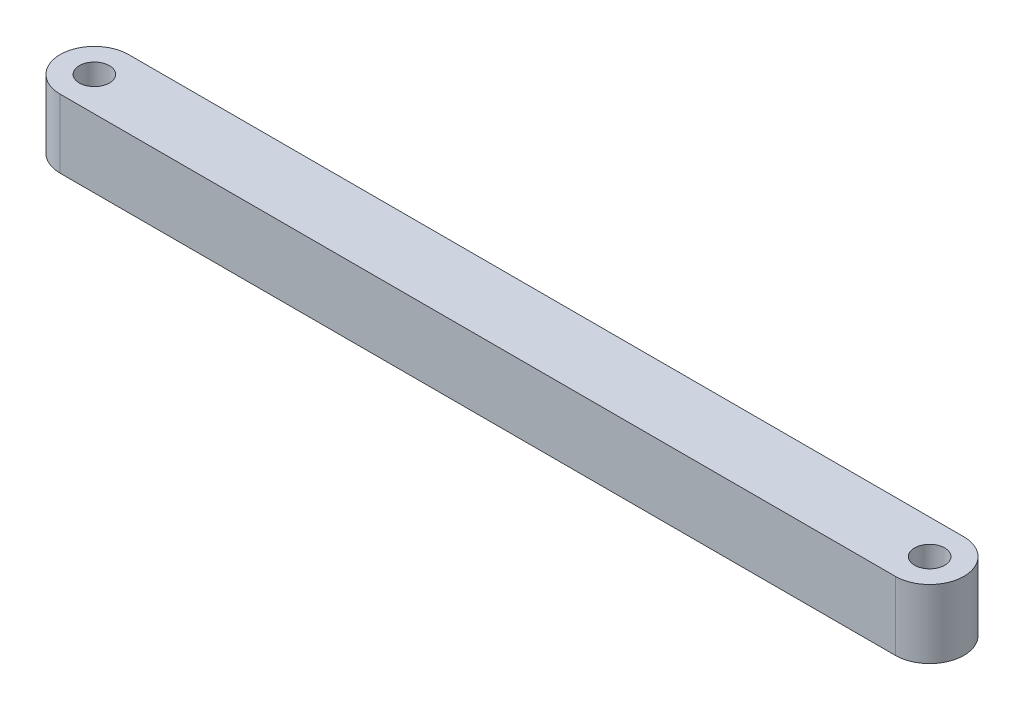
ISO-10303-21;
HEADER;
FILE_DESCRIPTION(('STEP AP214'),'2;1');
FILE_NAME('part.step','',(''),(''),'','','');
FILE_SCHEMA(('AUTOMOTIVE_DESIGN { 1 0 10303 214 1 1 1 1 }'));
ENDSEC;
DATA;
#1=APPLICATION_CONTEXT('core data for automotive mechanical design processes');
#2=APPLICATION_PROTOCOL_DEFINITION('international standard','automotive_design',2000,#1);
#3=PRODUCT_CONTEXT('',#1,'mechanical');
#4=PRODUCT('Part','Part','',(#3));
#5=PRODUCT_RELATED_PRODUCT_CATEGORY('part','',(#4));
#6=PRODUCT_DEFINITION_FORMATION('','',#4);
#7=PRODUCT_DEFINITION_CONTEXT('part definition',#1,'design');
#8=PRODUCT_DEFINITION('design','',#6,#7);
#9=PRODUCT_DEFINITION_SHAPE('','',#8);
#10=(LENGTH_UNIT() NAMED_UNIT(*) SI_UNIT(.MILLI.,.METRE.));
#11=(NAMED_UNIT(*) PLANE_ANGLE_UNIT() SI_UNIT($,.RADIAN.));
#12=(NAMED_UNIT(*) SI_UNIT($,.STERADIAN.) SOLID_ANGLE_UNIT());
#13=UNCERTAINTY_MEASURE_WITH_UNIT(LENGTH_MEASURE(1.E-05),#10,'distance_accuracy_value','');
#14=(GEOMETRIC_REPRESENTATION_CONTEXT(3) GLOBAL_UNCERTAINTY_ASSIGNED_CONTEXT((#13)) GLOBAL_UNIT_ASSIGNED_CONTEXT((#10,
#11,#12)) REPRESENTATION_CONTEXT('',''));
#15=CARTESIAN_POINT('',(0.,0.,0.));
#16=DIRECTION('',(0.,0.,1.));
#17=DIRECTION('',(1.,0.,0.));
#18=AXIS2_PLACEMENT_3D('',#15,#16,#17);
#19=CARTESIAN_POINT('',(-58.7,5.,0.));
#20=DIRECTION('',(0.,1.,0.));
#21=DIRECTION('',(0.,0.,1.));
#22=AXIS2_PLACEMENT_3D('',#19,#20,#21);
#23=PLANE('',#22);
#24=CARTESIAN_POINT('',(2.26469372,5.,0.));
#25=DIRECTION('',(0.,1.,0.));
#26=DIRECTION('',(0.,0.,1.));
#27=AXIS2_PLACEMENT_3D('',#24,#25,#26);
#28=CIRCLE('',#27,1.1);
#29=CARTESIAN_POINT('',(2.26469372,5.,1.1));
#30=VERTEX_POINT('',#29);
#31=EDGE_CURVE('E108',#30,#30,#28,.T.);
#32=ORIENTED_EDGE('',*,*,#31,.F.);
#33=EDGE_LOOP('',(#32));
#34=FACE_BOUND('',#33,.T.);
#35=CARTESIAN_POINT('',(-58.7,5.,0.));
#36=DIRECTION('',(0.,1.,0.));
#37=DIRECTION('',(0.,0.,1.));
#38=AXIS2_PLACEMENT_3D('',#35,#36,#37);
#39=CIRCLE('',#38,2.5);
#40=CARTESIAN_POINT('',(-58.7,5.,-2.5));
#41=VERTEX_POINT('',#40);
#42=CARTESIAN_POINT('',(-58.7,5.,2.5));
#43=VERTEX_POINT('',#42);
#44=EDGE_CURVE('E93',#41,#43,#39,.T.);
#45=ORIENTED_EDGE('',*,*,#44,.T.);
#46=DIRECTION('',(1.,0.,0.));
#47=VECTOR('',#46,1.);
#48=CARTESIAN_POINT('',(-58.7,5.,2.5));
#49=LINE('',#48,#47);
#50=CARTESIAN_POINT('',(2.26469372,5.,2.5));
#51=VERTEX_POINT('',#50);
#52=EDGE_CURVE('E88',#43,#51,#49,.T.);
#53=ORIENTED_EDGE('',*,*,#52,.T.);
#54=CARTESIAN_POINT('',(2.26469372,5.,0.));
#55=DIRECTION('',(0.,1.,0.));
#56=DIRECTION('',(0.,0.,1.));
#57=AXIS2_PLACEMENT_3D('',#54,#55,#56);
#58=CIRCLE('',#57,2.5);
#59=CARTESIAN_POINT('',(2.26469372,5.,-2.5));
#60=VERTEX_POINT('',#59);
#61=EDGE_CURVE('E91',#51,#60,#58,.T.);
#62=ORIENTED_EDGE('',*,*,#61,.T.);
#63=DIRECTION('',(-1.,0.,0.));
#64=VECTOR('',#63,1.);
#65=CARTESIAN_POINT('',(-58.7,5.,-2.5));
#66=LINE('',#65,#64);
#67=EDGE_CURVE('E58',#60,#41,#66,.T.);
#68=ORIENTED_EDGE('',*,*,#67,.T.);
#69=EDGE_LOOP('',(#45,#53,#62,#68));
#70=FACE_BOUND('',#69,.T.);
#71=CARTESIAN_POINT('',(-58.7,5.,0.));
#72=DIRECTION('',(0.,1.,0.));
#73=DIRECTION('',(0.,0.,1.));
#74=AXIS2_PLACEMENT_3D('',#71,#72,#73);
#75=CIRCLE('',#74,1.1);
#76=CARTESIAN_POINT('',(-58.7,5.,1.1));
#77=VERTEX_POINT('',#76);
#78=EDGE_CURVE('E123',#77,#77,#75,.T.);
#79=ORIENTED_EDGE('',*,*,#78,.F.);
#80=EDGE_LOOP('',(#79));
#81=FACE_BOUND('',#80,.T.);
#82=ADVANCED_FACE('F41',(#34,#70,#81),#23,.T.);
#83=CARTESIAN_POINT('',(-58.7,0.,0.));
#84=DIRECTION('',(0.,1.,0.));
#85=DIRECTION('',(0.,0.,1.));
#86=AXIS2_PLACEMENT_3D('',#83,#84,#85);
#87=PLANE('',#86);
#88=CARTESIAN_POINT('',(-58.7,0.,0.));
#89=DIRECTION('',(0.,1.,0.));
#90=DIRECTION('',(0.,0.,1.));
#91=AXIS2_PLACEMENT_3D('',#88,#89,#90);
#92=CIRCLE('',#91,2.5);
#93=CARTESIAN_POINT('',(-58.7,0.,-2.5));
#94=VERTEX_POINT('',#93);
#95=CARTESIAN_POINT('',(-58.7,0.,2.5));
#96=VERTEX_POINT('',#95);
#97=EDGE_CURVE('E105',#94,#96,#92,.T.);
#98=ORIENTED_EDGE('',*,*,#97,.F.);
#99=DIRECTION('',(-1.,0.,0.));
#100=VECTOR('',#99,1.);
#101=CARTESIAN_POINT('',(-58.7,0.,-2.5));
#102=LINE('',#101,#100);
#103=CARTESIAN_POINT('',(2.26469372,0.,-2.5));
#104=VERTEX_POINT('',#103);
#105=EDGE_CURVE('E81',#104,#94,#102,.T.);
#106=ORIENTED_EDGE('',*,*,#105,.F.);
#107=CARTESIAN_POINT('',(2.26469372,0.,0.));
#108=DIRECTION('',(0.,1.,0.));
#109=DIRECTION('',(0.,0.,1.));
#110=AXIS2_PLACEMENT_3D('',#107,#108,#109);
#111=CIRCLE('',#110,2.5);
#112=CARTESIAN_POINT('',(2.26469372,0.,2.5));
#113=VERTEX_POINT('',#112);
#114=EDGE_CURVE('E75',#113,#104,#111,.T.);
#115=ORIENTED_EDGE('',*,*,#114,.F.);
#116=DIRECTION('',(1.,0.,0.));
#117=VECTOR('',#116,1.);
#118=CARTESIAN_POINT('',(-58.7,0.,2.5));
#119=LINE('',#118,#117);
#120=EDGE_CURVE('E97',#96,#113,#119,.T.);
#121=ORIENTED_EDGE('',*,*,#120,.F.);
#122=EDGE_LOOP('',(#98,#106,#115,#121));
#123=FACE_BOUND('',#122,.T.);
#124=CARTESIAN_POINT('',(2.26469372,0.,0.));
#125=DIRECTION('',(0.,1.,0.));
#126=DIRECTION('',(0.,0.,1.));
#127=AXIS2_PLACEMENT_3D('',#124,#125,#126);
#128=CIRCLE('',#127,1.1);
#129=CARTESIAN_POINT('',(2.26469372,0.,1.1));
#130=VERTEX_POINT('',#129);
#131=EDGE_CURVE('E120',#130,#130,#128,.T.);
#132=ORIENTED_EDGE('',*,*,#131,.T.);
#133=EDGE_LOOP('',(#132));
#134=FACE_BOUND('',#133,.T.);
#135=CARTESIAN_POINT('',(-58.7,0.,0.));
#136=DIRECTION('',(0.,1.,0.));
#137=DIRECTION('',(0.,0.,1.));
#138=AXIS2_PLACEMENT_3D('',#135,#136,#137);
#139=CIRCLE('',#138,1.1);
#140=CARTESIAN_POINT('',(-58.7,0.,1.1));
#141=VERTEX_POINT('',#140);
#142=EDGE_CURVE('E126',#141,#141,#139,.T.);
#143=ORIENTED_EDGE('',*,*,#142,.T.);
#144=EDGE_LOOP('',(#143));
#145=FACE_BOUND('',#144,.T.);
#146=ADVANCED_FACE('F116',(#123,#134,#145),#87,.F.);
#147=CARTESIAN_POINT('',(-58.7,5.,0.));
#148=DIRECTION('',(0.,-1.,0.));
#149=DIRECTION('',(0.,0.,-1.));
#150=AXIS2_PLACEMENT_3D('',#147,#148,#149);
#151=CYLINDRICAL_SURFACE('',#150,2.5);
#152=ORIENTED_EDGE('',*,*,#97,.T.);
#153=DIRECTION('',(0.,-1.,0.));
#154=VECTOR('',#153,1.);
#155=CARTESIAN_POINT('',(-58.7,5.,2.5));
#156=LINE('',#155,#154);
#157=EDGE_CURVE('E11',#43,#96,#156,.T.);
#158=ORIENTED_EDGE('',*,*,#157,.F.);
#159=ORIENTED_EDGE('',*,*,#44,.F.);
#160=DIRECTION('',(0.,-1.,0.));
#161=VECTOR('',#160,1.);
#162=CARTESIAN_POINT('',(-58.7,5.,-2.5));
#163=LINE('',#162,#161);
#164=EDGE_CURVE('E101',#41,#94,#163,.T.);
#165=ORIENTED_EDGE('',*,*,#164,.T.);
#166=EDGE_LOOP('',(#152,#158,#159,#165));
#167=FACE_BOUND('',#166,.T.);
#168=ADVANCED_FACE('F43',(#167),#151,.T.);
#169=CARTESIAN_POINT('',(-58.7,5.,2.5));
#170=DIRECTION('',(0.,0.,-1.));
#171=DIRECTION('',(-1.,0.,0.));
#172=AXIS2_PLACEMENT_3D('',#169,#170,#171);
#173=PLANE('',#172);
#174=ORIENTED_EDGE('',*,*,#120,.T.);
#175=DIRECTION('',(0.,-1.,0.));
#176=VECTOR('',#175,1.);
#177=CARTESIAN_POINT('',(2.26469372,5.,2.5));
#178=LINE('',#177,#176);
#179=EDGE_CURVE('E50',#51,#113,#178,.T.);
#180=ORIENTED_EDGE('',*,*,#179,.F.);
#181=ORIENTED_EDGE('',*,*,#52,.F.);
#182=ORIENTED_EDGE('',*,*,#157,.T.);
#183=EDGE_LOOP('',(#174,#180,#181,#182));
#184=FACE_BOUND('',#183,.T.);
#185=ADVANCED_FACE('F96',(#184),#173,.F.);
#186=CARTESIAN_POINT('',(2.26469372,5.,0.));
#187=DIRECTION('',(0.,-1.,0.));
#188=DIRECTION('',(0.,0.,-1.));
#189=AXIS2_PLACEMENT_3D('',#186,#187,#188);
#190=CYLINDRICAL_SURFACE('',#189,2.5);
#191=ORIENTED_EDGE('',*,*,#114,.T.);
#192=DIRECTION('',(0.,-1.,0.));
#193=VECTOR('',#192,1.);
#194=CARTESIAN_POINT('',(2.26469372,5.,-2.5));
#195=LINE('',#194,#193);
#196=EDGE_CURVE('E98',#60,#104,#195,.T.);
#197=ORIENTED_EDGE('',*,*,#196,.F.);
#198=ORIENTED_EDGE('',*,*,#61,.F.);
#199=ORIENTED_EDGE('',*,*,#179,.T.);
#200=EDGE_LOOP('',(#191,#197,#198,#199));
#201=FACE_BOUND('',#200,.T.);
#202=ADVANCED_FACE('F99',(#201),#190,.T.);
#203=CARTESIAN_POINT('',(-58.7,5.,-2.5));
#204=DIRECTION('',(0.,0.,1.));
#205=DIRECTION('',(1.,0.,0.));
#206=AXIS2_PLACEMENT_3D('',#203,#204,#205);
#207=PLANE('',#206);
#208=ORIENTED_EDGE('',*,*,#105,.T.);
#209=ORIENTED_EDGE('',*,*,#164,.F.);
#210=ORIENTED_EDGE('',*,*,#67,.F.);
#211=ORIENTED_EDGE('',*,*,#196,.T.);
#212=EDGE_LOOP('',(#208,#209,#210,#211));
#213=FACE_BOUND('',#212,.T.);
#214=ADVANCED_FACE('F113',(#213),#207,.F.);
#215=CARTESIAN_POINT('',(2.26469372,5.,0.));
#216=DIRECTION('',(0.,-1.,0.));
#217=DIRECTION('',(0.,0.,-1.));
#218=AXIS2_PLACEMENT_3D('',#215,#216,#217);
#219=CYLINDRICAL_SURFACE('',#218,1.1);
#220=ORIENTED_EDGE('',*,*,#31,.T.);
#221=EDGE_LOOP('',(#220));
#222=FACE_BOUND('',#221,.T.);
#223=ORIENTED_EDGE('',*,*,#131,.F.);
#224=EDGE_LOOP('',(#223));
#225=FACE_BOUND('',#224,.T.);
#226=ADVANCED_FACE('F143',(#222,#225),#219,.F.);
#227=CARTESIAN_POINT('',(-58.7,5.,0.));
#228=DIRECTION('',(0.,-1.,0.));
#229=DIRECTION('',(0.,0.,-1.));
#230=AXIS2_PLACEMENT_3D('',#227,#228,#229);
#231=CYLINDRICAL_SURFACE('',#230,1.1);
#232=ORIENTED_EDGE('',*,*,#78,.T.);
#233=EDGE_LOOP('',(#232));
#234=FACE_BOUND('',#233,.T.);
#235=ORIENTED_EDGE('',*,*,#142,.F.);
#236=EDGE_LOOP('',(#235));
#237=FACE_BOUND('',#236,.T.);
#238=ADVANCED_FACE('F132',(#234,#237),#231,.F.);
#239=CLOSED_SHELL('',(#82,#146,#168,#185,#202,#214,#226,#238));
#240=MANIFOLD_SOLID_BREP('B2',#239);
#241=ADVANCED_BREP_SHAPE_REPRESENTATION('',(#18,#240),#14);
#242=SHAPE_DEFINITION_REPRESENTATION(#9,#241);
ENDSEC;
END-ISO-10303-21;
